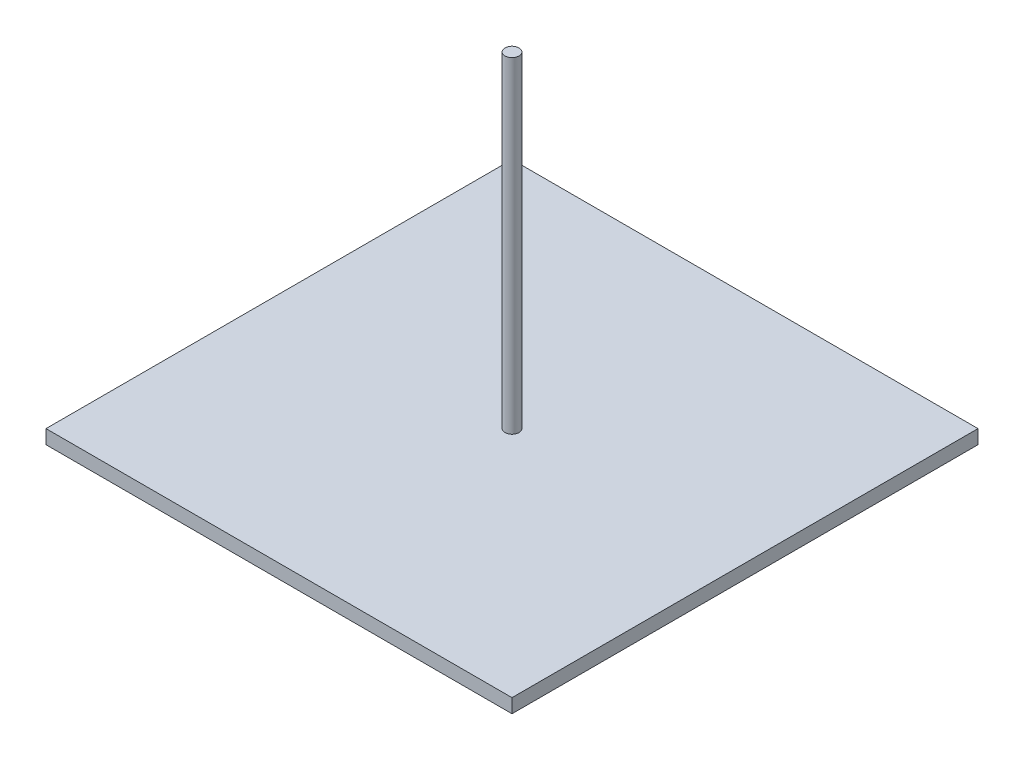
ISO-10303-21;
HEADER;
FILE_DESCRIPTION(('STEP AP214'),'2;1');
FILE_NAME('part.step','',(''),(''),'','','');
FILE_SCHEMA(('AUTOMOTIVE_DESIGN { 1 0 10303 214 1 1 1 1 }'));
ENDSEC;
DATA;
#1=APPLICATION_CONTEXT('core data for automotive mechanical design processes');
#2=APPLICATION_PROTOCOL_DEFINITION('international standard','automotive_design',2000,#1);
#3=PRODUCT_CONTEXT('',#1,'mechanical');
#4=PRODUCT('Part','Part','',(#3));
#5=PRODUCT_RELATED_PRODUCT_CATEGORY('part','',(#4));
#6=PRODUCT_DEFINITION_FORMATION('','',#4);
#7=PRODUCT_DEFINITION_CONTEXT('part definition',#1,'design');
#8=PRODUCT_DEFINITION('design','',#6,#7);
#9=PRODUCT_DEFINITION_SHAPE('','',#8);
#10=(LENGTH_UNIT() NAMED_UNIT(*) SI_UNIT(.MILLI.,.METRE.));
#11=(NAMED_UNIT(*) PLANE_ANGLE_UNIT() SI_UNIT($,.RADIAN.));
#12=(NAMED_UNIT(*) SI_UNIT($,.STERADIAN.) SOLID_ANGLE_UNIT());
#13=UNCERTAINTY_MEASURE_WITH_UNIT(LENGTH_MEASURE(1.E-05),#10,'distance_accuracy_value','');
#14=(GEOMETRIC_REPRESENTATION_CONTEXT(3) GLOBAL_UNCERTAINTY_ASSIGNED_CONTEXT((#13)) GLOBAL_UNIT_ASSIGNED_CONTEXT((#10,
#11,#12)) REPRESENTATION_CONTEXT('',''));
#15=CARTESIAN_POINT('',(0.,0.,0.));
#16=DIRECTION('',(0.,0.,1.));
#17=DIRECTION('',(1.,0.,0.));
#18=AXIS2_PLACEMENT_3D('',#15,#16,#17);
#19=CARTESIAN_POINT('',(-217.062548693336,-97.1399999999997,-87.7082453023184));
#20=DIRECTION('',(1.,0.,0.));
#21=DIRECTION('',(0.,0.,-1.));
#22=AXIS2_PLACEMENT_3D('',#19,#20,#21);
#23=PLANE('',#22);
#24=DIRECTION('',(0.,0.,-1.));
#25=VECTOR('',#24,1.);
#26=CARTESIAN_POINT('',(-217.062548693336,-94.1399999999997,-87.7082453023184));
#27=LINE('',#26,#25);
#28=CARTESIAN_POINT('',(-217.062548693336,-94.1400000000001,12.2917546976816));
#29=VERTEX_POINT('',#28);
#30=CARTESIAN_POINT('',(-217.062548693336,-94.1399999999997,-87.7082453023184));
#31=VERTEX_POINT('',#30);
#32=EDGE_CURVE('E113',#29,#31,#27,.T.);
#33=ORIENTED_EDGE('',*,*,#32,.T.);
#34=DIRECTION('',(0.,1.,0.));
#35=VECTOR('',#34,1.);
#36=CARTESIAN_POINT('',(-217.062548693336,-97.1399999999997,-87.7082453023184));
#37=LINE('',#36,#35);
#38=CARTESIAN_POINT('',(-217.062548693336,-97.1399999999997,-87.7082453023184));
#39=VERTEX_POINT('',#38);
#40=EDGE_CURVE('E55',#39,#31,#37,.T.);
#41=ORIENTED_EDGE('',*,*,#40,.F.);
#42=DIRECTION('',(0.,0.,-1.));
#43=VECTOR('',#42,1.);
#44=CARTESIAN_POINT('',(-217.062548693336,-97.1399999999997,-87.7082453023184));
#45=LINE('',#44,#43);
#46=CARTESIAN_POINT('',(-217.062548693336,-97.1400000000001,12.2917546976816));
#47=VERTEX_POINT('',#46);
#48=EDGE_CURVE('E99',#47,#39,#45,.T.);
#49=ORIENTED_EDGE('',*,*,#48,.F.);
#50=DIRECTION('',(0.,1.,0.));
#51=VECTOR('',#50,1.);
#52=CARTESIAN_POINT('',(-217.062548693336,-97.1400000000001,12.2917546976816));
#53=LINE('',#52,#51);
#54=EDGE_CURVE('E109',#47,#29,#53,.T.);
#55=ORIENTED_EDGE('',*,*,#54,.T.);
#56=EDGE_LOOP('',(#33,#41,#49,#55));
#57=FACE_BOUND('',#56,.T.);
#58=ADVANCED_FACE('F47',(#57),#23,.F.);
#59=CARTESIAN_POINT('',(-117.062548693336,-97.1399999999997,-87.7082453023184));
#60=DIRECTION('',(0.,0.,1.));
#61=DIRECTION('',(0.,-1.,0.));
#62=AXIS2_PLACEMENT_3D('',#59,#60,#61);
#63=PLANE('',#62);
#64=DIRECTION('',(1.,0.,0.));
#65=VECTOR('',#64,1.);
#66=CARTESIAN_POINT('',(-117.062548693336,-94.1399999999997,-87.7082453023184));
#67=LINE('',#66,#65);
#68=CARTESIAN_POINT('',(-117.062548693336,-94.1399999999997,-87.7082453023184));
#69=VERTEX_POINT('',#68);
#70=EDGE_CURVE('E104',#31,#69,#67,.T.);
#71=ORIENTED_EDGE('',*,*,#70,.T.);
#72=DIRECTION('',(0.,1.,0.));
#73=VECTOR('',#72,1.);
#74=CARTESIAN_POINT('',(-117.062548693336,-97.1399999999997,-87.7082453023184));
#75=LINE('',#74,#73);
#76=CARTESIAN_POINT('',(-117.062548693336,-97.1399999999997,-87.7082453023184));
#77=VERTEX_POINT('',#76);
#78=EDGE_CURVE('E102',#77,#69,#75,.T.);
#79=ORIENTED_EDGE('',*,*,#78,.F.);
#80=DIRECTION('',(1.,0.,0.));
#81=VECTOR('',#80,1.);
#82=CARTESIAN_POINT('',(-117.062548693336,-97.1399999999997,-87.7082453023184));
#83=LINE('',#82,#81);
#84=EDGE_CURVE('E94',#39,#77,#83,.T.);
#85=ORIENTED_EDGE('',*,*,#84,.F.);
#86=ORIENTED_EDGE('',*,*,#40,.T.);
#87=EDGE_LOOP('',(#71,#79,#85,#86));
#88=FACE_BOUND('',#87,.T.);
#89=ADVANCED_FACE('F103',(#88),#63,.F.);
#90=CARTESIAN_POINT('',(-117.062548693336,-97.1399999999997,-87.7082453023184));
#91=DIRECTION('',(-1.,0.,0.));
#92=DIRECTION('',(0.,0.,1.));
#93=AXIS2_PLACEMENT_3D('',#90,#91,#92);
#94=PLANE('',#93);
#95=DIRECTION('',(0.,0.,1.));
#96=VECTOR('',#95,1.);
#97=CARTESIAN_POINT('',(-117.062548693336,-94.1399999999997,-87.7082453023184));
#98=LINE('',#97,#96);
#99=CARTESIAN_POINT('',(-117.062548693336,-94.1400000000001,12.2917546976817));
#100=VERTEX_POINT('',#99);
#101=EDGE_CURVE('E80',#69,#100,#98,.T.);
#102=ORIENTED_EDGE('',*,*,#101,.T.);
#103=DIRECTION('',(0.,1.,0.));
#104=VECTOR('',#103,1.);
#105=CARTESIAN_POINT('',(-117.062548693336,-97.1400000000001,12.2917546976816));
#106=LINE('',#105,#104);
#107=CARTESIAN_POINT('',(-117.062548693336,-97.1400000000001,12.2917546976816));
#108=VERTEX_POINT('',#107);
#109=EDGE_CURVE('E105',#108,#100,#106,.T.);
#110=ORIENTED_EDGE('',*,*,#109,.F.);
#111=DIRECTION('',(0.,0.,1.));
#112=VECTOR('',#111,1.);
#113=CARTESIAN_POINT('',(-117.062548693336,-97.1399999999997,-87.7082453023184));
#114=LINE('',#113,#112);
#115=EDGE_CURVE('E97',#77,#108,#114,.T.);
#116=ORIENTED_EDGE('',*,*,#115,.F.);
#117=ORIENTED_EDGE('',*,*,#78,.T.);
#118=EDGE_LOOP('',(#102,#110,#116,#117));
#119=FACE_BOUND('',#118,.T.);
#120=ADVANCED_FACE('F107',(#119),#94,.F.);
#121=CARTESIAN_POINT('',(-117.062548693336,-97.1400000000001,12.2917546976816));
#122=DIRECTION('',(0.,0.,-1.));
#123=DIRECTION('',(0.,1.,0.));
#124=AXIS2_PLACEMENT_3D('',#121,#122,#123);
#125=PLANE('',#124);
#126=DIRECTION('',(-1.,0.,0.));
#127=VECTOR('',#126,1.);
#128=CARTESIAN_POINT('',(-117.062548693336,-94.1400000000001,12.2917546976817));
#129=LINE('',#128,#127);
#130=EDGE_CURVE('E86',#100,#29,#129,.T.);
#131=ORIENTED_EDGE('',*,*,#130,.T.);
#132=ORIENTED_EDGE('',*,*,#54,.F.);
#133=DIRECTION('',(-1.,0.,0.));
#134=VECTOR('',#133,1.);
#135=CARTESIAN_POINT('',(-117.062548693336,-97.1400000000001,12.2917546976816));
#136=LINE('',#135,#134);
#137=EDGE_CURVE('E63',#108,#47,#136,.T.);
#138=ORIENTED_EDGE('',*,*,#137,.F.);
#139=ORIENTED_EDGE('',*,*,#109,.T.);
#140=EDGE_LOOP('',(#131,#132,#138,#139));
#141=FACE_BOUND('',#140,.T.);
#142=ADVANCED_FACE('F136',(#141),#125,.F.);
#143=CARTESIAN_POINT('',(0.,-97.14,-3.38630587155709E-13));
#144=DIRECTION('',(0.,-1.,0.));
#145=DIRECTION('',(0.,0.,-1.));
#146=AXIS2_PLACEMENT_3D('',#143,#144,#145);
#147=PLANE('',#146);
#148=ORIENTED_EDGE('',*,*,#48,.T.);
#149=ORIENTED_EDGE('',*,*,#84,.T.);
#150=ORIENTED_EDGE('',*,*,#115,.T.);
#151=ORIENTED_EDGE('',*,*,#137,.T.);
#152=EDGE_LOOP('',(#148,#149,#150,#151));
#153=FACE_BOUND('',#152,.T.);
#154=ADVANCED_FACE('F95',(#153),#147,.T.);
#155=CARTESIAN_POINT('',(0.,-94.14,-3.2815614313918E-13));
#156=DIRECTION('',(0.,-1.,0.));
#157=DIRECTION('',(0.,0.,-1.));
#158=AXIS2_PLACEMENT_3D('',#155,#156,#157);
#159=PLANE('',#158);
#160=CARTESIAN_POINT('',(-167.062548693336,-94.1399999999999,-37.7082453023184));
#161=DIRECTION('',(0.,-1.,0.));
#162=DIRECTION('',(0.,0.,-1.));
#163=AXIS2_PLACEMENT_3D('',#160,#161,#162);
#164=CIRCLE('',#163,1.5);
#165=CARTESIAN_POINT('',(-167.062548693336,-94.1399999999999,-39.2082453023184));
#166=VERTEX_POINT('',#165);
#167=EDGE_CURVE('E13',#166,#166,#164,.F.);
#168=ORIENTED_EDGE('',*,*,#167,.F.);
#169=EDGE_LOOP('',(#168));
#170=FACE_BOUND('',#169,.T.);
#171=ORIENTED_EDGE('',*,*,#32,.F.);
#172=ORIENTED_EDGE('',*,*,#130,.F.);
#173=ORIENTED_EDGE('',*,*,#101,.F.);
#174=ORIENTED_EDGE('',*,*,#70,.F.);
#175=EDGE_LOOP('',(#171,#172,#173,#174));
#176=FACE_BOUND('',#175,.T.);
#177=ADVANCED_FACE('F124',(#170,#176),#159,.F.);
#178=CARTESIAN_POINT('',(-167.062548693336,-19.8973593128808,-37.7082453023181));
#179=DIRECTION('',(0.,-1.,0.));
#180=DIRECTION('',(0.,0.,-1.));
#181=AXIS2_PLACEMENT_3D('',#178,#179,#180);
#182=CYLINDRICAL_SURFACE('',#181,1.5);
#183=CARTESIAN_POINT('',(-167.062548693336,-24.14,-37.7082453023181));
#184=DIRECTION('',(0.,-1.,0.));
#185=DIRECTION('',(0.,0.,-1.));
#186=AXIS2_PLACEMENT_3D('',#183,#184,#185);
#187=CIRCLE('',#186,1.5);
#188=CARTESIAN_POINT('',(-167.062548693336,-24.14,-39.2082453023181));
#189=VERTEX_POINT('',#188);
#190=EDGE_CURVE('E116',#189,#189,#187,.T.);
#191=ORIENTED_EDGE('',*,*,#190,.T.);
#192=EDGE_LOOP('',(#191));
#193=FACE_BOUND('',#192,.T.);
#194=ORIENTED_EDGE('',*,*,#167,.T.);
#195=EDGE_LOOP('',(#194));
#196=FACE_BOUND('',#195,.T.);
#197=ADVANCED_FACE('F126',(#193,#196),#182,.T.);
#198=CARTESIAN_POINT('',(-231.062548693336,-24.14,-54.6163345995198));
#199=DIRECTION('',(0.,-1.,0.));
#200=DIRECTION('',(0.,0.,1.));
#201=AXIS2_PLACEMENT_3D('',#198,#199,#200);
#202=PLANE('',#201);
#203=ORIENTED_EDGE('',*,*,#190,.F.);
#204=EDGE_LOOP('',(#203));
#205=FACE_BOUND('',#204,.T.);
#206=ADVANCED_FACE('F133',(#205),#202,.F.);
#207=CLOSED_SHELL('',(#58,#89,#120,#142,#154,#177,#197,#206));
#208=MANIFOLD_SOLID_BREP('B2',#207);
#209=ADVANCED_BREP_SHAPE_REPRESENTATION('',(#18,#208),#14);
#210=SHAPE_DEFINITION_REPRESENTATION(#9,#209);
ENDSEC;
END-ISO-10303-21;
